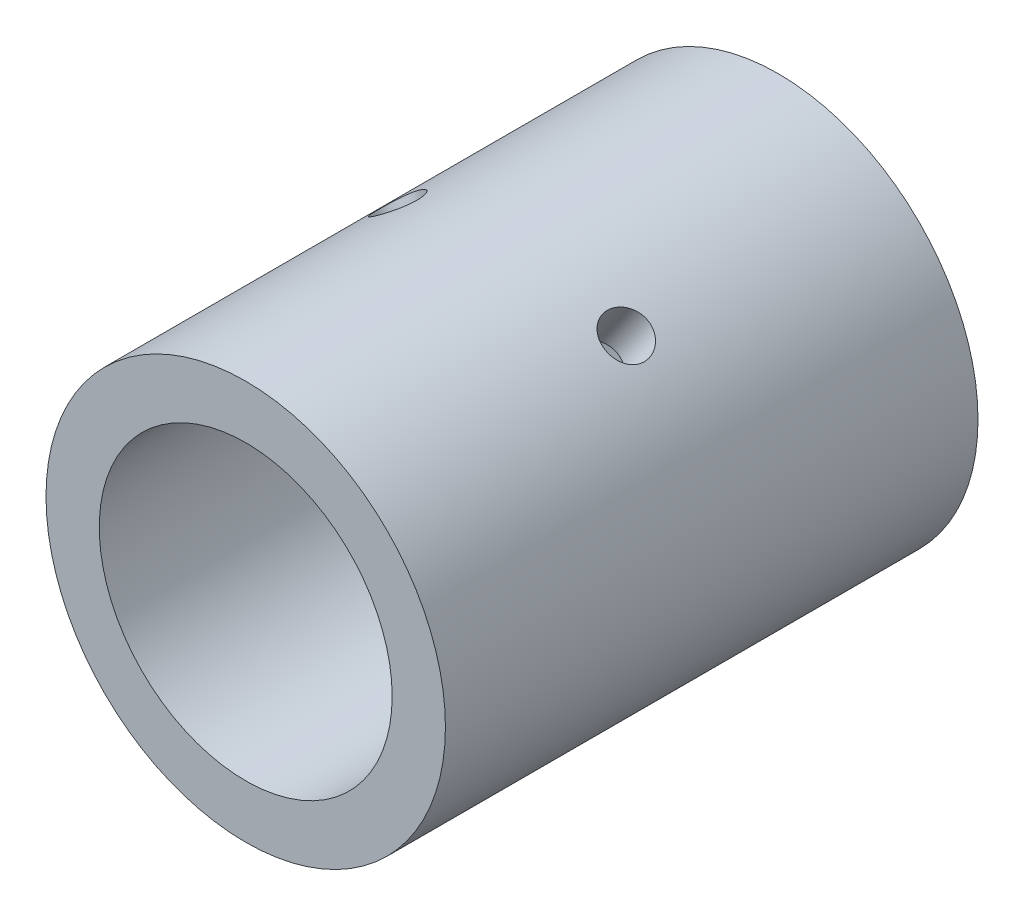
ISO-10303-21;
HEADER;
FILE_DESCRIPTION(('STEP AP214'),'2;1');
FILE_NAME('part.step','',(''),(''),'','','');
FILE_SCHEMA(('AUTOMOTIVE_DESIGN { 1 0 10303 214 1 1 1 1 }'));
ENDSEC;
DATA;
#1=APPLICATION_CONTEXT('core data for automotive mechanical design processes');
#2=APPLICATION_PROTOCOL_DEFINITION('international standard','automotive_design',2000,#1);
#3=PRODUCT_CONTEXT('',#1,'mechanical');
#4=PRODUCT('Part','Part','',(#3));
#5=PRODUCT_RELATED_PRODUCT_CATEGORY('part','',(#4));
#6=PRODUCT_DEFINITION_FORMATION('','',#4);
#7=PRODUCT_DEFINITION_CONTEXT('part definition',#1,'design');
#8=PRODUCT_DEFINITION('design','',#6,#7);
#9=PRODUCT_DEFINITION_SHAPE('','',#8);
#10=(LENGTH_UNIT() NAMED_UNIT(*) SI_UNIT(.MILLI.,.METRE.));
#11=(NAMED_UNIT(*) PLANE_ANGLE_UNIT() SI_UNIT($,.RADIAN.));
#12=(NAMED_UNIT(*) SI_UNIT($,.STERADIAN.) SOLID_ANGLE_UNIT());
#13=UNCERTAINTY_MEASURE_WITH_UNIT(LENGTH_MEASURE(1.E-05),#10,'distance_accuracy_value','');
#14=(GEOMETRIC_REPRESENTATION_CONTEXT(3) GLOBAL_UNCERTAINTY_ASSIGNED_CONTEXT((#13)) GLOBAL_UNIT_ASSIGNED_CONTEXT((#10,
#11,#12)) REPRESENTATION_CONTEXT('',''));
#15=CARTESIAN_POINT('',(0.,0.,0.));
#16=DIRECTION('',(0.,0.,1.));
#17=DIRECTION('',(1.,0.,0.));
#18=AXIS2_PLACEMENT_3D('',#15,#16,#17);
#19=CARTESIAN_POINT('',(0.,0.,50.));
#20=DIRECTION('',(0.,0.,1.));
#21=DIRECTION('',(1.,0.,0.));
#22=AXIS2_PLACEMENT_3D('',#19,#20,#21);
#23=PLANE('',#22);
#24=CARTESIAN_POINT('',(0.,0.,50.));
#25=DIRECTION('',(0.,0.,1.));
#26=DIRECTION('',(1.,0.,0.));
#27=AXIS2_PLACEMENT_3D('',#24,#25,#26);
#28=CIRCLE('',#27,37.5);
#29=CARTESIAN_POINT('',(37.5,0.,50.));
#30=VERTEX_POINT('',#29);
#31=EDGE_CURVE('E56',#30,#30,#28,.T.);
#32=ORIENTED_EDGE('',*,*,#31,.T.);
#33=EDGE_LOOP('',(#32));
#34=FACE_BOUND('',#33,.T.);
#35=CARTESIAN_POINT('',(0.,0.,50.));
#36=DIRECTION('',(0.,0.,1.));
#37=DIRECTION('',(1.,0.,0.));
#38=AXIS2_PLACEMENT_3D('',#35,#36,#37);
#39=CIRCLE('',#38,27.5);
#40=CARTESIAN_POINT('',(27.5,0.,50.));
#41=VERTEX_POINT('',#40);
#42=EDGE_CURVE('E88',#41,#41,#39,.T.);
#43=ORIENTED_EDGE('',*,*,#42,.F.);
#44=EDGE_LOOP('',(#43));
#45=FACE_BOUND('',#44,.T.);
#46=ADVANCED_FACE('F41',(#34,#45),#23,.T.);
#47=CARTESIAN_POINT('',(0.,0.,-50.));
#48=DIRECTION('',(0.,0.,1.));
#49=DIRECTION('',(1.,0.,0.));
#50=AXIS2_PLACEMENT_3D('',#47,#48,#49);
#51=PLANE('',#50);
#52=CARTESIAN_POINT('',(0.,0.,-50.));
#53=DIRECTION('',(0.,0.,1.));
#54=DIRECTION('',(1.,0.,0.));
#55=AXIS2_PLACEMENT_3D('',#52,#53,#54);
#56=CIRCLE('',#55,37.5);
#57=CARTESIAN_POINT('',(37.5,0.,-50.));
#58=VERTEX_POINT('',#57);
#59=EDGE_CURVE('E60',#58,#58,#56,.T.);
#60=ORIENTED_EDGE('',*,*,#59,.F.);
#61=EDGE_LOOP('',(#60));
#62=FACE_BOUND('',#61,.T.);
#63=CARTESIAN_POINT('',(0.,0.,-50.));
#64=DIRECTION('',(0.,0.,1.));
#65=DIRECTION('',(1.,0.,0.));
#66=AXIS2_PLACEMENT_3D('',#63,#64,#65);
#67=CIRCLE('',#66,27.5);
#68=CARTESIAN_POINT('',(27.5,0.,-50.));
#69=VERTEX_POINT('',#68);
#70=EDGE_CURVE('E84',#69,#69,#67,.T.);
#71=ORIENTED_EDGE('',*,*,#70,.T.);
#72=EDGE_LOOP('',(#71));
#73=FACE_BOUND('',#72,.T.);
#74=ADVANCED_FACE('F94',(#62,#73),#51,.F.);
#75=CARTESIAN_POINT('',(0.,0.,50.));
#76=DIRECTION('',(0.,0.,-1.));
#77=DIRECTION('',(-1.,0.,0.));
#78=AXIS2_PLACEMENT_3D('',#75,#76,#77);
#79=CYLINDRICAL_SURFACE('',#78,37.5);
#80=CARTESIAN_POINT('',(-24.8519297834276,28.0825851025076,0.));
#81=CARTESIAN_POINT('',(-24.8519232126386,28.0825935253991,-0.237900433354277));
#82=CARTESIAN_POINT('',(-24.8368328502316,28.0959676837694,-0.475953816980261));
#83=CARTESIAN_POINT('',(-24.7767584883169,28.1489570148796,-0.945447863894278));
#84=CARTESIAN_POINT('',(-24.7317424079328,28.1886003484732,-1.17688115231711));
#85=CARTESIAN_POINT('',(-24.6128281801696,28.2924881106126,-1.62626879856685));
#86=CARTESIAN_POINT('',(-24.538948600107,28.3567167233997,-1.84423171742822));
#87=CARTESIAN_POINT('',(-24.3639485121721,28.5072143230606,-2.26068044375288));
#88=CARTESIAN_POINT('',(-24.2628330323328,28.5934792416494,-2.45916983701578));
#89=CARTESIAN_POINT('',(-24.035118867654,28.785156522106,-2.83199938924964));
#90=CARTESIAN_POINT('',(-23.9084167740876,28.8906464075902,-3.0062365436486));
#91=CARTESIAN_POINT('',(-23.6326671935249,29.1166405072765,-3.32472721426439));
#92=CARTESIAN_POINT('',(-23.4836186402661,29.2371454378759,-3.4689792989579));
#93=CARTESIAN_POINT('',(-23.1662676293562,29.4892379940152,-3.72376866729174));
#94=CARTESIAN_POINT('',(-22.9979141433158,29.620854737524,-3.83421362739328));
#95=CARTESIAN_POINT('',(-22.6464933460242,29.8903884435936,-4.01766265702758));
#96=CARTESIAN_POINT('',(-22.4634264882074,30.0283052119447,-4.09066787986069));
#97=CARTESIAN_POINT('',(-22.0882319350648,30.3053481913352,-4.19685979430765));
#98=CARTESIAN_POINT('',(-21.8961467308655,30.4444666190975,-4.23021688852113));
#99=CARTESIAN_POINT('',(-21.5075027565678,30.7202553305132,-4.25669334724828));
#100=CARTESIAN_POINT('',(-21.310944133069,30.8569256941313,-4.24981402847393));
#101=CARTESIAN_POINT('',(-20.9199280158049,31.1233408309925,-4.19615036713129));
#102=CARTESIAN_POINT('',(-20.7254650194342,31.2531145044652,-4.14954927121657));
#103=CARTESIAN_POINT('',(-20.3434686810264,31.5031017989022,-4.01805085956167));
#104=CARTESIAN_POINT('',(-20.1559354505703,31.6233152659672,-3.93315292746914));
#105=CARTESIAN_POINT('',(-19.7930709215236,31.8516947012972,-3.72727293257863));
#106=CARTESIAN_POINT('',(-19.6177678160326,31.9598331573747,-3.60621068687373));
#107=CARTESIAN_POINT('',(-19.2852614382403,32.1615697816507,-3.33149684683836));
#108=CARTESIAN_POINT('',(-19.1280588488236,32.2551674013085,-3.17784402357246));
#109=CARTESIAN_POINT('',(-18.8359317969724,32.4266338713459,-2.84128221353307));
#110=CARTESIAN_POINT('',(-18.7011374973248,32.5044113736114,-2.65821366637662));
#111=CARTESIAN_POINT('',(-18.4593648562826,32.6423235014219,-2.26856767691959));
#112=CARTESIAN_POINT('',(-18.3523865765001,32.7024580878881,-2.06199018254837));
#113=CARTESIAN_POINT('',(-18.1698678723339,32.8042204266746,-1.6310582247291));
#114=CARTESIAN_POINT('',(-18.0943372123201,32.8458424311799,-1.40669826559263));
#115=CARTESIAN_POINT('',(-17.9774264870106,32.9099775676179,-0.946637199236175));
#116=CARTESIAN_POINT('',(-17.9360450770757,32.9324914519407,-0.710936538947215));
#117=CARTESIAN_POINT('',(-17.8890510124024,32.9580426941467,-0.236285013247306));
#118=CARTESIAN_POINT('',(-17.8832411513126,32.9611874338888,0.00264055926833782));
#119=CARTESIAN_POINT('',(-17.9070726441196,32.9482461741822,0.478187869023159));
#120=CARTESIAN_POINT('',(-17.9367133796968,32.9321605101451,0.714809646371943));
#121=CARTESIAN_POINT('',(-18.030253208885,32.8810396447194,1.17837291297283));
#122=CARTESIAN_POINT('',(-18.0940583308155,32.8460564201482,1.40533912082649));
#123=CARTESIAN_POINT('',(-18.2536369117556,32.7576405078637,1.84391935889829));
#124=CARTESIAN_POINT('',(-18.3494113027853,32.7042072822645,2.05553294131285));
#125=CARTESIAN_POINT('',(-18.5701583377885,32.579369345639,2.45841424942143));
#126=CARTESIAN_POINT('',(-18.695256409804,32.5078873290631,2.64958928807515));
#127=CARTESIAN_POINT('',(-18.9702743171425,32.3481670921794,3.00522390789999));
#128=CARTESIAN_POINT('',(-19.1201949435965,32.2599283377967,3.16968263725218));
#129=CARTESIAN_POINT('',(-19.4407791453502,32.0677583720426,3.46799300272149));
#130=CARTESIAN_POINT('',(-19.6115360674731,31.9637559958688,3.60169853764576));
#131=CARTESIAN_POINT('',(-19.9678183609251,31.7424030709917,3.83369893932002));
#132=CARTESIAN_POINT('',(-20.1533434807194,31.6250527496184,3.93199440902342));
#133=CARTESIAN_POINT('',(-20.5329787956211,31.3798929299073,4.09014005075171));
#134=CARTESIAN_POINT('',(-20.7270686593463,31.2521076471411,4.15007653258683));
#135=CARTESIAN_POINT('',(-21.1183564836418,30.9890394712055,4.23008406855424));
#136=CARTESIAN_POINT('',(-21.3155543299417,30.853756853231,4.25015658492645));
#137=CARTESIAN_POINT('',(-21.7061774497788,30.5801962703489,4.24984244539268));
#138=CARTESIAN_POINT('',(-21.8996176688077,30.441939331104,4.2296818139457));
#139=CARTESIAN_POINT('',(-22.2784659402804,30.1657906101405,4.14995003131687));
#140=CARTESIAN_POINT('',(-22.4638739918948,30.0278988284597,4.0903788760655));
#141=CARTESIAN_POINT('',(-22.8216984322428,29.7568561697848,3.93358401042797));
#142=CARTESIAN_POINT('',(-22.9941178412432,29.6237041944592,3.83636908588328));
#143=CARTESIAN_POINT('',(-23.3216927860642,29.3665126720762,3.60706979335884));
#144=CARTESIAN_POINT('',(-23.4768482663216,29.2424731543474,3.47498531315736));
#145=CARTESIAN_POINT('',(-23.7669939326466,29.0071566809652,3.17885369568625));
#146=CARTESIAN_POINT('',(-23.9018709460418,28.8959521024359,3.01463815318464));
#147=CARTESIAN_POINT('',(-24.1473787571118,28.6911089703668,2.65924952674051));
#148=CARTESIAN_POINT('',(-24.2580037702577,28.5974746083982,2.46807002925087));
#149=CARTESIAN_POINT('',(-24.4527990127577,28.4310944841572,2.06349235288068));
#150=CARTESIAN_POINT('',(-24.5368835557501,28.3584164437304,1.85002511054533));
#151=CARTESIAN_POINT('',(-24.6761668410719,28.2373048649821,1.40755369294856));
#152=CARTESIAN_POINT('',(-24.7313975782508,28.1888444752619,1.17856704633993));
#153=CARTESIAN_POINT('',(-24.798313928048,28.1299630036006,0.790282081098051));
#154=CARTESIAN_POINT('',(-24.8183976607201,28.1122297512306,0.633450232921299));
#155=CARTESIAN_POINT('',(-24.8452077442763,28.0885380216167,0.317768332268913));
#156=CARTESIAN_POINT('',(-24.8519341727369,28.0825794759877,0.158918291519929));
#157=CARTESIAN_POINT('',(-24.8519297834276,28.0825851025076,0.));
#158=B_SPLINE_CURVE_WITH_KNOTS('',3,(#80,#81,#82,#83,#84,#85,#86,#87,#88,#89,#90,#91,#92,#93,
#94,#95,#96,#97,#98,#99,#100,#101,#102,#103,#104,#105,#106,#107,#108,#109,#110,#111,#112,#113,
#114,#115,#116,#117,#118,#119,#120,#121,#122,#123,#124,#125,#126,#127,#128,#129,#130,#131,#132,
#133,#134,#135,#136,#137,#138,#139,#140,#141,#142,#143,#144,#145,#146,#147,#148,#149,#150,#151,
#152,#153,#154,#155,#156,#157),.UNSPECIFIED.,.T.,.F.,(4,2,2,2,2,2,2,2,2,2,2,2,2,2,2,2,2,2,2,2,2,
2,2,2,2,2,2,2,2,2,2,2,2,2,2,2,2,2,4),(0.,0.713120854061162,1.42700742120796,2.14043551344138,
2.8537319895174,3.56997113330616,4.2862444633639,5.0044567560163,5.72264692340006,
6.43773910930397,7.15280789438485,7.86459562906135,8.57639481971558,9.28978406338097,
10.0032002125291,10.7206255991479,11.438052574844,12.1557021431488,12.8733234523928,
13.586962686676,14.3005894740374,15.0122633860087,15.7239580476632,16.4387543002099,
17.1535733387451,17.8717212280769,18.5898568883946,19.3063709701618,20.022858769174,
20.7353327661447,21.447806836685,22.1601147199636,22.8724248957122,23.5885735799337,
24.3048928928208,25.0235017442743,25.7413120582306,26.2176819595732,26.694049094247),.UNSPECIFIED.);
#159=CARTESIAN_POINT('',(-24.8519297834276,28.0825851025076,0.));
#160=VERTEX_POINT('',#159);
#161=EDGE_CURVE('E11',#160,#160,#158,.T.);
#162=ORIENTED_EDGE('',*,*,#161,.T.);
#163=EDGE_LOOP('',(#162));
#164=FACE_BOUND('',#163,.T.);
#165=CARTESIAN_POINT('',(17.8891374069712,32.9579848114915,0.));
#166=CARTESIAN_POINT('',(17.8891475692424,32.9579815177681,-0.237900433354277));
#167=CARTESIAN_POINT('',(17.9068763750854,32.9483754471319,-0.475953816980261));
#168=CARTESIAN_POINT('',(17.9772167003823,32.9100474311633,-0.945447863894279));
#169=CARTESIAN_POINT('',(18.0298656546886,32.8813049712472,-1.17688115231711));
#170=CARTESIAN_POINT('',(18.1681592793839,32.8050938562084,-1.62626879856685));
#171=CARTESIAN_POINT('',(18.2537827374251,32.7576372393479,-1.84423171742822));
#172=CARTESIAN_POINT('',(18.45505777643,32.6446641586847,-2.26068044375288));
#173=CARTESIAN_POINT('',(18.5707038147676,32.5791510282523,-2.45916983701578));
#174=CARTESIAN_POINT('',(18.8287043720258,32.4307271989893,-2.83199938924964));
#175=CARTESIAN_POINT('',(18.971167107184,32.3477458423794,-3.0062365436486));
#176=CARTESIAN_POINT('',(19.2778440060664,32.1659205307053,-3.32472721426439));
#177=CARTESIAN_POINT('',(19.442059207667,32.0670758187043,-3.4689792989579));
#178=CARTESIAN_POINT('',(19.7874891606622,31.8550841477354,-3.72376866729174));
#179=CARTESIAN_POINT('',(19.9687487267342,31.7418991966986,-3.83421362739328));
#180=CARTESIAN_POINT('',(20.3422205528382,31.503857623474,-4.01766265702759));
#181=CARTESIAN_POINT('',(20.534432475289,31.3790013609515,-4.0906678798607));
#182=CARTESIAN_POINT('',(20.9230918135037,31.1211880875229,-4.19685979430765));
#183=CARTESIAN_POINT('',(21.1195173825582,30.9882683431771,-4.23021688852113));
#184=CARTESIAN_POINT('',(21.5115980673635,30.7173877630227,-4.25669334724828));
#185=CARTESIAN_POINT('',(21.7072532081165,30.5794270923221,-4.24981402847393));
#186=CARTESIAN_POINT('',(22.0913369347601,30.3031114756141,-4.19615036713129));
#187=CARTESIAN_POINT('',(22.2797945599848,30.1647612433096,-4.14954927121657));
#188=CARTESIAN_POINT('',(22.6453562182696,29.8913027932135,-4.01805085956167));
#189=CARTESIAN_POINT('',(22.8224600685486,29.7561946276369,-3.93315292746914));
#190=CARTESIAN_POINT('',(23.1611735168999,29.4933238745511,-3.72727293257863));
#191=CARTESIAN_POINT('',(23.3227476193645,29.365578370167,-3.60621068687372));
#192=CARTESIAN_POINT('',(23.6260419155282,29.1221225697402,-3.33149684683835));
#193=CARTESIAN_POINT('',(23.7677613602071,29.0064127277872,-3.17784402357246));
#194=CARTESIAN_POINT('',(24.028800472957,28.7905480794884,-2.84128221353307));
#195=CARTESIAN_POINT('',(24.147989783584,28.6904843432579,-2.65821366637662));
#196=CARTESIAN_POINT('',(24.3602759057459,28.5104611022827,-2.26856767691959));
#197=CARTESIAN_POINT('',(24.4533726594861,28.4305016420688,-2.06199018254837));
#198=CARTESIAN_POINT('',(24.6114230516763,28.2937949323053,-1.6310582247291));
#199=CARTESIAN_POINT('',(24.6763679493356,28.2370548923936,-1.40669826559262));
#200=CARTESIAN_POINT('',(24.7766210868062,28.1491302550863,-0.946637199236172));
#201=CARTESIAN_POINT('',(24.8119304935265,28.1179446514757,-0.710936538947211));
#202=CARTESIAN_POINT('',(24.8520137240144,28.0825237152029,-0.236285013247302));
#203=CARTESIAN_POINT('',(24.856955902267,28.0781397959463,0.00264055926834132));
#204=CARTESIAN_POINT('',(24.8366442454315,28.0961079023797,0.478187869023162));
#205=CARTESIAN_POINT('',(24.811390937005,28.1184594617568,0.714809646371945));
#206=CARTESIAN_POINT('',(24.7313605312106,28.1888737832747,1.17837291297283));
#207=CARTESIAN_POINT('',(24.6766644162822,28.2368660180393,1.40533912082649));
#208=CARTESIAN_POINT('',(24.5390015468236,28.3565808099924,1.84391935889829));
#209=CARTESIAN_POINT('',(24.4560339680764,28.4283040590255,2.05553294131285));
#210=CARTESIAN_POINT('',(24.2632247476847,28.5930413299013,2.45841424942143));
#211=CARTESIAN_POINT('',(24.1532675636689,28.6861467754943,2.64958928807515));
#212=CARTESIAN_POINT('',(23.9091179715941,28.8899515352932,3.00522390789999));
#213=CARTESIAN_POINT('',(23.774924791086,29.0006514102548,3.16968263725219));
#214=CARTESIAN_POINT('',(23.4846978376985,29.2361760197532,3.46799300272149));
#215=CARTESIAN_POINT('',(23.3285652652855,29.361064131815,3.60169853764576));
#216=CARTESIAN_POINT('',(22.9987058341182,29.6201528147965,3.83369893932003));
#217=CARTESIAN_POINT('',(22.8249792750143,29.7543532271023,3.93199440902343));
#218=CARTESIAN_POINT('',(22.4647614767044,30.0272441344298,4.09014005075171));
#219=CARTESIAN_POINT('',(22.2782999464347,30.1659238064151,4.15007653258683));
#220=CARTESIAN_POINT('',(21.8972684049972,30.4436394722711,4.23008406855424));
#221=CARTESIAN_POINT('',(21.702698691511,30.5826754528848,4.25015658492645));
#222=CARTESIAN_POINT('',(21.3120348550058,30.8561778863385,4.24984244539268));
#223=CARTESIAN_POINT('',(21.1159553779876,30.9906655745469,4.2296818139457));
#224=CARTESIAN_POINT('',(20.726886722551,31.2522180745242,4.14995003131686));
#225=CARTESIAN_POINT('',(20.5338975444516,31.3792828855266,4.0903788760655));
#226=CARTESIAN_POINT('',(20.1568175918034,31.6228258226911,3.93358401042797));
#227=CARTESIAN_POINT('',(19.9727247521684,31.7393064113241,3.83636908588327));
#228=CARTESIAN_POINT('',(19.6190065468789,31.9591614883792,3.60706979335884));
#229=CARTESIAN_POINT('',(19.4493812277879,32.0625359346198,3.47498531315735));
#230=CARTESIAN_POINT('',(19.1290204118194,32.2547007022654,3.17885369568625));
#231=CARTESIAN_POINT('',(18.9783916345251,32.3434094305795,3.01463815318463));
#232=CARTESIAN_POINT('',(18.7019334381713,32.5040508315976,2.65924952674051));
#233=CARTESIAN_POINT('',(18.5761099363259,32.5759795022245,2.46807002925087));
#234=CARTESIAN_POINT('',(18.3531398645721,32.7021218002265,2.06349235288068));
#235=CARTESIAN_POINT('',(18.2560862388442,32.7562780709952,1.85002511054533));
#236=CARTESIAN_POINT('',(18.094640892794,32.8457389468891,1.40755369294856));
#237=CARTESIAN_POINT('',(18.0302129975276,32.8810644336189,1.17856704633993));
#238=CARTESIAN_POINT('',(17.951995773558,32.9238065843565,0.790282081098048));
#239=CARTESIAN_POINT('',(17.9284629260364,32.936613990229,0.633450232921296));
#240=CARTESIAN_POINT('',(17.8970303939241,32.9537041791512,0.317768332268911));
#241=CARTESIAN_POINT('',(17.8891306185398,32.9579870117099,0.158918291519928));
#242=CARTESIAN_POINT('',(17.8891374069712,32.9579848114915,0.));
#243=B_SPLINE_CURVE_WITH_KNOTS('',3,(#165,#166,#167,#168,#169,#170,#171,#172,#173,#174,#175,
#176,#177,#178,#179,#180,#181,#182,#183,#184,#185,#186,#187,#188,#189,#190,#191,#192,#193,#194,
#195,#196,#197,#198,#199,#200,#201,#202,#203,#204,#205,#206,#207,#208,#209,#210,#211,#212,#213,
#214,#215,#216,#217,#218,#219,#220,#221,#222,#223,#224,#225,#226,#227,#228,#229,#230,#231,#232,
#233,#234,#235,#236,#237,#238,#239,#240,#241,#242),.UNSPECIFIED.,.T.,.F.,(4,2,2,2,2,2,2,2,2,2,2,
2,2,2,2,2,2,2,2,2,2,2,2,2,2,2,2,2,2,2,2,2,2,2,2,2,2,2,4),(0.,0.713120854061162,1.42700742120796,
2.14043551344139,2.8537319895174,3.56997113330617,4.2862444633639,5.0044567560163,
5.72264692340006,6.43773910930397,7.15280789438486,7.86459562906135,8.57639481971559,
9.28978406338097,10.0032002125291,10.7206255991479,11.438052574844,12.1557021431488,
12.8733234523928,13.586962686676,14.3005894740374,15.0122633860087,15.7239580476632,
16.4387543002099,17.1535733387451,17.8717212280769,18.5898568883946,19.3063709701618,
20.022858769174,20.7353327661447,21.4478068366851,22.1601147199636,22.8724248957122,
23.5885735799337,24.3048928928208,25.0235017442744,25.7413120582306,26.2176819595732,
26.694049094247),.UNSPECIFIED.);
#244=CARTESIAN_POINT('',(17.8891374069712,32.9579848114915,0.));
#245=VERTEX_POINT('',#244);
#246=EDGE_CURVE('E52',#245,#245,#243,.T.);
#247=ORIENTED_EDGE('',*,*,#246,.T.);
#248=EDGE_LOOP('',(#247));
#249=FACE_BOUND('',#248,.T.);
#250=ORIENTED_EDGE('',*,*,#31,.F.);
#251=EDGE_LOOP('',(#250));
#252=FACE_BOUND('',#251,.T.);
#253=ORIENTED_EDGE('',*,*,#59,.T.);
#254=EDGE_LOOP('',(#253));
#255=FACE_BOUND('',#254,.T.);
#256=ADVANCED_FACE('F43',(#164,#249,#252,#255),#79,.T.);
#257=CARTESIAN_POINT('',(0.,0.,50.));
#258=DIRECTION('',(0.,0.,-1.));
#259=DIRECTION('',(-1.,0.,0.));
#260=AXIS2_PLACEMENT_3D('',#257,#258,#259);
#261=CYLINDRICAL_SURFACE('',#260,27.5);
#262=CARTESIAN_POINT('',(-19.0652420782642,19.8183385907393,0.));
#263=CARTESIAN_POINT('',(-19.0652364336061,19.8183474950034,-0.237189895672535));
#264=CARTESIAN_POINT('',(-19.0507226705682,19.8323379502276,-0.474515338541054));
#265=CARTESIAN_POINT('',(-18.992919195788,19.8876987242892,-0.942524676365377));
#266=CARTESIAN_POINT('',(-18.9496018182283,19.9290953665504,-1.17320196331415));
#267=CARTESIAN_POINT('',(-18.8350790365477,20.037364231023,-1.62107324258104));
#268=CARTESIAN_POINT('',(-18.7638955337685,20.1042164453392,-1.8382776689449));
#269=CARTESIAN_POINT('',(-18.5950425718121,20.2604926908228,-2.25335681730198));
#270=CARTESIAN_POINT('',(-18.4973765833692,20.3499137640608,-2.45123406765165));
#271=CARTESIAN_POINT('',(-18.2766168321367,20.5484163801855,-2.82375089637734));
#272=CARTESIAN_POINT('',(-18.1533355656174,20.6576420965295,-2.9982025554264));
#273=CARTESIAN_POINT('',(-17.8843018382396,20.8909883306899,-3.31728669266068));
#274=CARTESIAN_POINT('',(-17.7385481178646,21.0151096832775,-3.4619174984102));
#275=CARTESIAN_POINT('',(-17.4269074482622,21.2742593737563,-3.71795098521073));
#276=CARTESIAN_POINT('',(-17.2609214368946,21.4093401986956,-3.82918011761586));
#277=CARTESIAN_POINT('',(-16.9133346815599,21.6849775098961,-4.01413868420648));
#278=CARTESIAN_POINT('',(-16.7317348130565,21.8255336889147,-4.08787021926885));
#279=CARTESIAN_POINT('',(-16.359088740534,22.1062019974696,-4.19516957993275));
#280=CARTESIAN_POINT('',(-16.1681292205213,22.246308757997,-4.22905238861548));
#281=CARTESIAN_POINT('',(-15.7806960233058,22.5227940422805,-4.25667090555628));
#282=CARTESIAN_POINT('',(-15.5842226712639,22.6591727849524,-4.25040897629255));
#283=CARTESIAN_POINT('',(-15.1931683012598,22.9231945135083,-4.19816357350694));
#284=CARTESIAN_POINT('',(-14.9985854233911,23.0509020313397,-4.15251900127319));
#285=CARTESIAN_POINT('',(-14.6154336631468,23.2957253923539,-4.02333640282086));
#286=CARTESIAN_POINT('',(-14.4268649433689,23.4128409493315,-3.93979735302237));
#287=CARTESIAN_POINT('',(-14.0607956554769,23.634509610857,-3.73685289357465));
#288=CARTESIAN_POINT('',(-13.8833422861682,23.7390106893204,-3.61730560954443));
#289=CARTESIAN_POINT('',(-13.5459228139265,23.9331553627456,-3.34584186498101));
#290=CARTESIAN_POINT('',(-13.385957932923,24.0227979197605,-3.19392314482328));
#291=CARTESIAN_POINT('',(-13.0871621377057,24.1868890541725,-2.86014315242752));
#292=CARTESIAN_POINT('',(-12.9485692371921,24.2611692778382,-2.67798590381293));
#293=CARTESIAN_POINT('',(-12.6993267102052,24.3925606255799,-2.28990301656667));
#294=CARTESIAN_POINT('',(-12.5886772765066,24.4496716312104,-2.08397721397625));
#295=CARTESIAN_POINT('',(-12.3992383758266,24.5462881150695,-1.65388984521502));
#296=CARTESIAN_POINT('',(-12.3204764714895,24.585778365432,-1.42971270326821));
#297=CARTESIAN_POINT('',(-12.1979519304508,24.6467989468089,-0.969657142961153));
#298=CARTESIAN_POINT('',(-12.1541866671791,24.6683306256563,-0.733779604151246));
#299=CARTESIAN_POINT('',(-12.1036348315181,24.6931735651151,-0.259616602493656));
#300=CARTESIAN_POINT('',(-12.0964726148161,24.6966699194678,-0.0213808461005108));
#301=CARTESIAN_POINT('',(-12.1183928085896,24.6859210682895,0.453006865755198));
#302=CARTESIAN_POINT('',(-12.1474740226519,24.6716764483965,0.68915888974362));
#303=CARTESIAN_POINT('',(-12.2404916384488,24.6256574692253,1.15138492632648));
#304=CARTESIAN_POINT('',(-12.3042408151202,24.593977260253,1.37750607928962));
#305=CARTESIAN_POINT('',(-12.4640801406864,24.5133569892877,1.81474077087493));
#306=CARTESIAN_POINT('',(-12.5601719766423,24.464416026931,2.0258535259316));
#307=CARTESIAN_POINT('',(-12.7821392051664,24.3491810953723,2.42893049805718));
#308=CARTESIAN_POINT('',(-12.9082460563413,24.2827518214893,2.6207285417759));
#309=CARTESIAN_POINT('',(-13.1854565804448,24.1333475951936,2.9780208574439));
#310=CARTESIAN_POINT('',(-13.3365617567426,24.0503716476222,3.14351354624635));
#311=CARTESIAN_POINT('',(-13.6601857631008,23.8680551301192,3.44499033552512));
#312=CARTESIAN_POINT('',(-13.832882631109,23.7685759443536,3.58069969632205));
#313=CARTESIAN_POINT('',(-14.1929579350048,23.5553319731487,3.81684070827031));
#314=CARTESIAN_POINT('',(-14.3803359491636,23.4415675980076,3.91727337232158));
#315=CARTESIAN_POINT('',(-14.7630416232964,23.2024410717171,4.07957409072731));
#316=CARTESIAN_POINT('',(-14.9583355185041,23.0771257643383,4.141590662626));
#317=CARTESIAN_POINT('',(-15.3514928776388,22.8174741642489,4.22577881603715));
#318=CARTESIAN_POINT('',(-15.5493561599633,22.6831385063215,4.24795319829621));
#319=CARTESIAN_POINT('',(-15.9396863634682,22.4105440548246,4.25175594625542));
#320=CARTESIAN_POINT('',(-16.1321880208197,22.2723406699558,4.23380405954982));
#321=CARTESIAN_POINT('',(-16.5085600768996,21.9948205629881,4.15876571630969));
#322=CARTESIAN_POINT('',(-16.6924305083454,21.8555038451119,4.10167940813066));
#323=CARTESIAN_POINT('',(-17.0466310920171,21.5803767409519,3.95014486004951));
#324=CARTESIAN_POINT('',(-17.2169722743707,21.4445635605928,3.85572743886117));
#325=CARTESIAN_POINT('',(-17.5402482127311,21.1809642840685,3.63225607792887));
#326=CARTESIAN_POINT('',(-17.6931823338613,21.0531784807568,3.50320087543894));
#327=CARTESIAN_POINT('',(-17.9797272836107,20.8090183559422,3.21260730703308));
#328=CARTESIAN_POINT('',(-18.1131315640391,20.6927696936526,3.05075966039103));
#329=CARTESIAN_POINT('',(-18.3560495783137,20.477593759228,2.69982608822626));
#330=CARTESIAN_POINT('',(-18.4655577028688,20.3786705550772,2.510733784656));
#331=CARTESIAN_POINT('',(-18.6590440451005,20.201668851069,2.10934227024648));
#332=CARTESIAN_POINT('',(-18.7428653553515,20.1237188047831,1.89691079246035));
#333=CARTESIAN_POINT('',(-18.8823435428971,19.992906865704,1.45587311353745));
#334=CARTESIAN_POINT('',(-18.938029364479,19.9400191935728,1.22728381188729));
#335=CARTESIAN_POINT('',(-19.007741663002,19.8735314781447,0.83141887761052));
#336=CARTESIAN_POINT('',(-19.0292809590316,19.8528805638717,0.666576200488493));
#337=CARTESIAN_POINT('',(-19.0580330553265,19.8252810775689,0.334511468726512));
#338=CARTESIAN_POINT('',(-19.0652460594276,19.8183323105837,0.167289447974162));
#339=CARTESIAN_POINT('',(-19.0652420782642,19.8183385907393,0.));
#340=B_SPLINE_CURVE_WITH_KNOTS('',3,(#262,#263,#264,#265,#266,#267,#268,#269,#270,#271,#272,
#273,#274,#275,#276,#277,#278,#279,#280,#281,#282,#283,#284,#285,#286,#287,#288,#289,#290,#291,
#292,#293,#294,#295,#296,#297,#298,#299,#300,#301,#302,#303,#304,#305,#306,#307,#308,#309,#310,
#311,#312,#313,#314,#315,#316,#317,#318,#319,#320,#321,#322,#323,#324,#325,#326,#327,#328,#329,
#330,#331,#332,#333,#334,#335,#336,#337,#338,#339),.UNSPECIFIED.,.T.,.F.,(4,2,2,2,2,2,2,2,2,2,2,
2,2,2,2,2,2,2,2,2,2,2,2,2,2,2,2,2,2,2,2,2,2,2,2,2,2,2,4),(0.,0.710958151962999,1.42260016619311,
2.13368398571009,2.84467465720873,3.5610657052299,4.27749691951512,4.99758860837298,
5.71763994822732,6.43196057136554,7.14623915782581,7.85443174684393,8.56264346621874,
9.2736829131593,9.98477200908025,10.7032831300637,11.4217992077319,12.1409350304078,
12.8600168753913,13.571703999611,14.2833676313192,14.9912255335346,15.69912036483,
16.4126618161551,17.1262461946149,17.8461595837231,18.566052300265,19.2831442345998,
20.0001857582667,20.7097616890682,21.4193349299382,22.1283236013929,22.8373381230662,
23.5533800884949,24.2695899544605,24.9900913615951,25.7098500384503,26.2112942028506,
26.7127312326085),.UNSPECIFIED.);
#341=CARTESIAN_POINT('',(-19.0652420782642,19.8183385907393,0.));
#342=VERTEX_POINT('',#341);
#343=EDGE_CURVE('E85',#342,#342,#340,.T.);
#344=ORIENTED_EDGE('',*,*,#343,.F.);
#345=EDGE_LOOP('',(#344));
#346=FACE_BOUND('',#345,.T.);
#347=CARTESIAN_POINT('',(12.1024497018077,24.6937382997232,0.));
#348=CARTESIAN_POINT('',(12.1024599996658,24.6937360409173,-0.237189895672535));
#349=CARTESIAN_POINT('',(12.1205707265158,24.6848825823918,-0.474515338541054));
#350=CARTESIAN_POINT('',(12.1923627901115,24.6494995835642,-0.942524676365378));
#351=CARTESIAN_POINT('',(12.2460783250511,24.6229530490389,-1.17320196331415));
#352=CARTESIAN_POINT('',(12.3869868762614,24.5523669687264,-1.62107324258104));
#353=CARTESIAN_POINT('',(12.4741536005605,24.5083411603651,-1.8382776689449));
#354=CARTESIAN_POINT('',(12.6787563494948,24.4031209018956,-2.25335681730198));
#355=CARTESIAN_POINT('',(12.7961884075246,24.3419287015393,-2.45123406765165));
#356=CARTESIAN_POINT('',(13.0582241328608,24.202374285557,-2.82375089637734));
#357=CARTESIAN_POINT('',(13.2030274089536,24.1238851842865,-2.9982025554264));
#358=CARTESIAN_POINT('',(13.5143160972795,23.9508852883791,-3.31728669266068));
#359=CARTESIAN_POINT('',(13.6808027247209,23.8563735956924,-3.4619174984102));
#360=CARTESIAN_POINT('',(14.0309111630264,23.6521615724106,-3.71795098521073));
#361=CARTESIAN_POINT('',(14.2146161768294,23.5423861054811,-3.82918011761586));
#362=CARTESIAN_POINT('',(14.5925121960555,23.3100349090928,-4.01413868420648));
#363=CARTESIAN_POINT('',(14.7867026133386,23.1874598972178,-4.08787021926885));
#364=CARTESIAN_POINT('',(15.1778970149101,22.9332813478224,-4.19516957993275));
#365=CARTESIAN_POINT('',(15.374866306304,22.8017574303142,-4.22905238861548));
#366=CARTESIAN_POINT('',(15.7671874453419,22.5322528504013,-4.25667090555628));
#367=CARTESIAN_POINT('',(15.9625393874877,22.3942725684218,-4.25040897629255));
#368=CARTESIAN_POINT('',(16.3443871292158,22.1171024120445,-4.19816357350694));
#369=CARTESIAN_POINT('',(16.5309442051182,21.9779328611325,-4.15251900127319));
#370=CARTESIAN_POINT('',(16.8920485308135,21.7016225004134,-4.02333640282086));
#371=CARTESIAN_POINT('',(17.0665954560498,21.5644817455102,-3.93979735302237));
#372=CARTESIAN_POINT('',(17.4000989318567,21.2963042843675,-3.73685289357465));
#373=CARTESIAN_POINT('',(17.5589904509575,21.1652941365283,-3.61730560954443));
#374=CARTESIAN_POINT('',(17.8568310241971,20.914624937384,-3.34584186498101));
#375=CARTESIAN_POINT('',(17.9957786850602,20.7949666793185,-3.19392314482328));
#376=CARTESIAN_POINT('',(18.2521680939089,20.570312948741,-2.86014315242752));
#377=CARTESIAN_POINT('',(18.3693702356554,20.4654835555794,-2.67798590381293));
#378=CARTESIAN_POINT('',(18.5780836803663,20.2762106797702,-2.28990301656667));
#379=CARTESIAN_POINT('',(18.6695948060955,20.1917673377607,-2.08397721397625));
#380=CARTESIAN_POINT('',(18.8251765229862,20.046797784359,-1.65388984521502));
#381=CARTESIAN_POINT('',(18.8892233776548,19.9862922651434,-1.42971270326821));
#382=CARTESIAN_POINT('',(18.9884698287777,19.8920271260524,-0.969657142961155));
#383=CARTESIAN_POINT('',(19.0236715901206,19.8582654989947,-0.733779604151247));
#384=CARTESIAN_POINT('',(19.0643060630869,19.8192590977712,-0.259616602493655));
#385=CARTESIAN_POINT('',(19.0700411838547,19.8137246392047,-0.0213808461005103));
#386=CARTESIAN_POINT('',(19.0524434199044,19.8306465599192,0.453006865755199));
#387=CARTESIAN_POINT('',(19.0291114947033,19.8531020152397,0.68915888974362));
#388=CARTESIAN_POINT('',(18.9540539012734,19.9247705645553,1.15138492632648));
#389=CARTESIAN_POINT('',(18.9024807401352,19.9738399258413,1.37750607928962));
#390=CARTESIAN_POINT('',(18.772054197384,20.0964660039567,1.81474077087493));
#391=CARTESIAN_POINT('',(18.6931993926973,20.1700239981625,2.0258535259316));
#392=CARTESIAN_POINT('',(18.5089967145414,20.3391922970551,2.42893049805718));
#393=CARTESIAN_POINT('',(18.4034425327561,20.4349738247602,2.6207285417759));
#394=CARTESIAN_POINT('',(18.1682369006066,20.6443672537733,2.9780208574439));
#395=CARTESIAN_POINT('',(18.0385840009164,20.757980227422,3.14351354624635));
#396=CARTESIAN_POINT('',(17.7565765857332,20.999731396659,3.44499033552511));
#397=CARTESIAN_POINT('',(17.6040309213994,21.1279894837856,3.58069969632204));
#398=CARTESIAN_POINT('',(17.2804941281846,21.3934158561889,3.81684070827031));
#399=CARTESIAN_POINT('',(17.1095035290975,21.5305838855004,3.91727337232158));
#400=CARTESIAN_POINT('',(16.7539050473897,21.808423494621,4.07957409072732));
#401=CARTESIAN_POINT('',(16.5693527317448,21.9490793674416,4.14159066262601));
#402=CARTESIAN_POINT('',(16.1908923028446,22.2297203591508,4.22577881603715));
#403=CARTESIAN_POINT('',(15.9969848482024,22.3697055244976,4.24795319829621));
#404=CARTESIAN_POINT('',(15.6073290615165,22.6432631430302,4.25175594625542));
#405=CARTESIAN_POINT('',(15.4116209161499,22.7768871884316,4.23380405954982));
#406=CARTESIAN_POINT('',(15.0221104949484,23.035643765439,4.15876571630969));
#407=CARTESIAN_POINT('',(14.8283082118915,23.1607763292337,4.10167940813066));
#408=CARTESIAN_POINT('',(14.4486295679407,23.3995169923905,3.95014486004951));
#409=CARTESIAN_POINT('',(14.262746808949,23.5131345010521,3.85572743886117));
#410=CARTESIAN_POINT('',(13.9044776311828,23.7267582524697,3.63225607792887));
#411=CARTESIAN_POINT('',(13.7320917047413,23.8267639987984,3.50320087543894));
#412=CARTESIAN_POINT('',(13.4046520923803,24.0125204927179,3.21260730703308));
#413=CARTESIAN_POINT('',(13.2497871311382,24.09812012648,3.05075966039103));
#414=CARTESIAN_POINT('',(12.9645050393301,24.2527938880177,2.69982608822625));
#415=CARTESIAN_POINT('',(12.8340936499094,24.3218641361164,2.51073378465599));
#416=CARTESIAN_POINT('',(12.6015902282847,24.4431436759605,2.10934227024648));
#417=CARTESIAN_POINT('',(12.4996725684542,24.4952494566651,1.89691079246034));
#418=CARTESIAN_POINT('',(12.3290452048957,24.5815757621097,1.45587311353744));
#419=CARTESIAN_POINT('',(12.2603013769848,24.6158146685302,1.22728381188729));
#420=CARTESIAN_POINT('',(12.1739803510917,24.6585826630701,0.831418877610517));
#421=CARTESIAN_POINT('',(12.1472079662217,24.6717599519466,0.66657620048849));
#422=CARTESIAN_POINT('',(12.1114391365098,24.689338504406,0.33451146872651));
#423=CARTESIAN_POINT('',(12.1024424387538,24.6937398928533,0.167289447974161));
#424=CARTESIAN_POINT('',(12.1024497018077,24.6937382997232,0.));
#425=B_SPLINE_CURVE_WITH_KNOTS('',3,(#347,#348,#349,#350,#351,#352,#353,#354,#355,#356,#357,
#358,#359,#360,#361,#362,#363,#364,#365,#366,#367,#368,#369,#370,#371,#372,#373,#374,#375,#376,
#377,#378,#379,#380,#381,#382,#383,#384,#385,#386,#387,#388,#389,#390,#391,#392,#393,#394,#395,
#396,#397,#398,#399,#400,#401,#402,#403,#404,#405,#406,#407,#408,#409,#410,#411,#412,#413,#414,
#415,#416,#417,#418,#419,#420,#421,#422,#423,#424),.UNSPECIFIED.,.T.,.F.,(4,2,2,2,2,2,2,2,2,2,2,
2,2,2,2,2,2,2,2,2,2,2,2,2,2,2,2,2,2,2,2,2,2,2,2,2,2,2,4),(0.,0.710958151962999,1.42260016619311,
2.13368398571009,2.84467465720873,3.5610657052299,4.27749691951513,4.99758860837298,
5.71763994822732,6.43196057136554,7.14623915782581,7.85443174684393,8.56264346621874,
9.2736829131593,9.98477200908025,10.7032831300637,11.4217992077319,12.1409350304078,
12.8600168753913,13.571703999611,14.2833676313192,14.9912255335346,15.69912036483,
16.4126618161551,17.126246194615,17.8461595837231,18.566052300265,19.2831442345998,
20.0001857582667,20.7097616890682,21.4193349299382,22.1283236013929,22.8373381230662,
23.553380088495,24.2695899544605,24.9900913615951,25.7098500384503,26.2112942028506,
26.7127312326085),.UNSPECIFIED.);
#426=CARTESIAN_POINT('',(12.1024497018077,24.6937382997232,0.));
#427=VERTEX_POINT('',#426);
#428=EDGE_CURVE('E78',#427,#427,#425,.T.);
#429=ORIENTED_EDGE('',*,*,#428,.F.);
#430=EDGE_LOOP('',(#429));
#431=FACE_BOUND('',#430,.T.);
#432=ORIENTED_EDGE('',*,*,#42,.T.);
#433=EDGE_LOOP('',(#432));
#434=FACE_BOUND('',#433,.T.);
#435=ORIENTED_EDGE('',*,*,#70,.F.);
#436=EDGE_LOOP('',(#435));
#437=FACE_BOUND('',#436,.T.);
#438=ADVANCED_FACE('F71',(#346,#431,#434,#437),#261,.F.);
#439=CARTESIAN_POINT('',(21.5091163631642,30.7182016608372,0.));
#440=DIRECTION('',(0.573576436351044,0.819152044288993,0.));
#441=DIRECTION('',(-0.819152044288993,0.573576436351044,0.));
#442=AXIS2_PLACEMENT_3D('',#439,#440,#441);
#443=CYLINDRICAL_SURFACE('',#442,4.25);
#444=ORIENTED_EDGE('',*,*,#428,.T.);
#445=EDGE_LOOP('',(#444));
#446=FACE_BOUND('',#445,.T.);
#447=ORIENTED_EDGE('',*,*,#246,.F.);
#448=EDGE_LOOP('',(#447));
#449=FACE_BOUND('',#448,.T.);
#450=ADVANCED_FACE('F66',(#446,#449),#443,.F.);
#451=CARTESIAN_POINT('',(-21.5091163631642,30.7182016608372,0.));
#452=DIRECTION('',(-0.573576436351044,0.819152044288993,0.));
#453=DIRECTION('',(-0.819152044288993,-0.573576436351044,0.));
#454=AXIS2_PLACEMENT_3D('',#451,#452,#453);
#455=CYLINDRICAL_SURFACE('',#454,4.25);
#456=ORIENTED_EDGE('',*,*,#343,.T.);
#457=EDGE_LOOP('',(#456));
#458=FACE_BOUND('',#457,.T.);
#459=ORIENTED_EDGE('',*,*,#161,.F.);
#460=EDGE_LOOP('',(#459));
#461=FACE_BOUND('',#460,.T.);
#462=ADVANCED_FACE('F70',(#458,#461),#455,.F.);
#463=CLOSED_SHELL('',(#46,#74,#256,#438,#450,#462));
#464=MANIFOLD_SOLID_BREP('B2',#463);
#465=ADVANCED_BREP_SHAPE_REPRESENTATION('',(#18,#464),#14);
#466=SHAPE_DEFINITION_REPRESENTATION(#9,#465);
ENDSEC;
END-ISO-10303-21;
